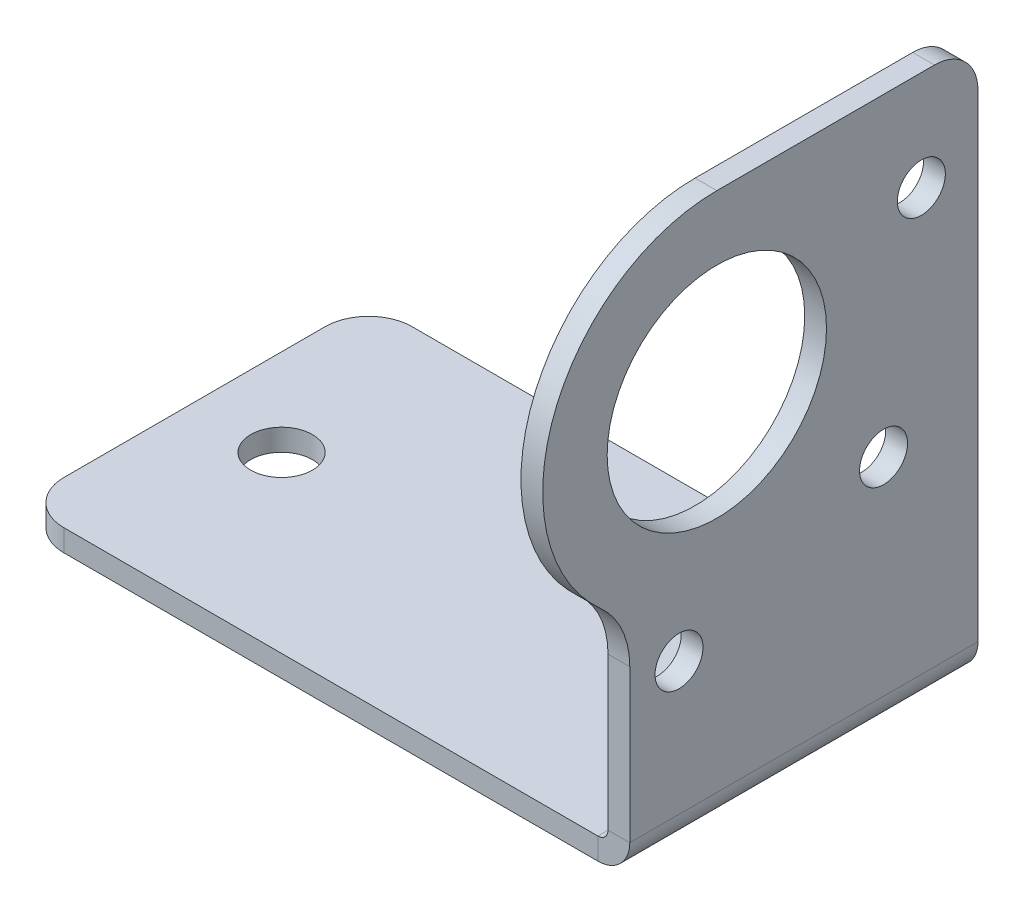
ISO-10303-21;
HEADER;
FILE_DESCRIPTION(('STEP AP214'),'2;1');
FILE_NAME('part.step','',(''),(''),'','','');
FILE_SCHEMA(('AUTOMOTIVE_DESIGN { 1 0 10303 214 1 1 1 1 }'));
ENDSEC;
DATA;
#1=APPLICATION_CONTEXT('core data for automotive mechanical design processes');
#2=APPLICATION_PROTOCOL_DEFINITION('international standard','automotive_design',2000,#1);
#3=PRODUCT_CONTEXT('',#1,'mechanical');
#4=PRODUCT('Part','Part','',(#3));
#5=PRODUCT_RELATED_PRODUCT_CATEGORY('part','',(#4));
#6=PRODUCT_DEFINITION_FORMATION('','',#4);
#7=PRODUCT_DEFINITION_CONTEXT('part definition',#1,'design');
#8=PRODUCT_DEFINITION('design','',#6,#7);
#9=PRODUCT_DEFINITION_SHAPE('','',#8);
#10=(LENGTH_UNIT() NAMED_UNIT(*) SI_UNIT(.MILLI.,.METRE.));
#11=(NAMED_UNIT(*) PLANE_ANGLE_UNIT() SI_UNIT($,.RADIAN.));
#12=(NAMED_UNIT(*) SI_UNIT($,.STERADIAN.) SOLID_ANGLE_UNIT());
#13=UNCERTAINTY_MEASURE_WITH_UNIT(LENGTH_MEASURE(1.E-05),#10,'distance_accuracy_value','');
#14=(GEOMETRIC_REPRESENTATION_CONTEXT(3) GLOBAL_UNCERTAINTY_ASSIGNED_CONTEXT((#13)) GLOBAL_UNIT_ASSIGNED_CONTEXT((#10,
#11,#12)) REPRESENTATION_CONTEXT('',''));
#15=CARTESIAN_POINT('',(0.,0.,0.));
#16=DIRECTION('',(0.,0.,1.));
#17=DIRECTION('',(1.,0.,0.));
#18=AXIS2_PLACEMENT_3D('',#15,#16,#17);
#19=CARTESIAN_POINT('',(36.5125,11.8578001841658,19.05));
#20=DIRECTION('',(1.,0.,0.));
#21=DIRECTION('',(0.,0.,-1.));
#22=AXIS2_PLACEMENT_3D('',#19,#20,#21);
#23=PLANE('',#22);
#24=CARTESIAN_POINT('',(36.5124999999999,26.0568318412894,6.35));
#25=DIRECTION('',(-1.,0.,0.));
#26=DIRECTION('',(0.,0.,1.));
#27=AXIS2_PLACEMENT_3D('',#24,#25,#26);
#28=CIRCLE('',#27,8.);
#29=CARTESIAN_POINT('',(36.5124999999999,26.0568318412894,14.35));
#30=VERTEX_POINT('',#29);
#31=EDGE_CURVE('E236',#30,#30,#28,.T.);
#32=ORIENTED_EDGE('',*,*,#31,.F.);
#33=EDGE_LOOP('',(#32));
#34=FACE_BOUND('',#33,.T.);
#35=CARTESIAN_POINT('',(36.5125,10.4230087622206,9.10666482046241));
#36=DIRECTION('',(-1.,0.,0.));
#37=DIRECTION('',(0.,0.,1.));
#38=AXIS2_PLACEMENT_3D('',#35,#36,#37);
#39=CIRCLE('',#38,1.75);
#40=CARTESIAN_POINT('',(36.5125,10.4230087622206,10.8566648204624));
#41=VERTEX_POINT('',#40);
#42=EDGE_CURVE('E230',#41,#41,#39,.T.);
#43=ORIENTED_EDGE('',*,*,#42,.F.);
#44=EDGE_LOOP('',(#43));
#45=FACE_BOUND('',#44,.T.);
#46=CARTESIAN_POINT('',(36.5125,15.8525785375157,-5.81095553451387));
#47=DIRECTION('',(-1.,0.,0.));
#48=DIRECTION('',(0.,0.,1.));
#49=AXIS2_PLACEMENT_3D('',#46,#47,#48);
#50=CIRCLE('',#49,1.75000000000001);
#51=CARTESIAN_POINT('',(36.5125,15.8525785375157,-4.06095553451386));
#52=VERTEX_POINT('',#51);
#53=EDGE_CURVE('E223',#52,#52,#50,.T.);
#54=ORIENTED_EDGE('',*,*,#53,.F.);
#55=EDGE_LOOP('',(#54));
#56=FACE_BOUND('',#55,.T.);
#57=CARTESIAN_POINT('',(36.5124999999999,31.4864016165846,-8.56762035497623));
#58=DIRECTION('',(-1.,0.,0.));
#59=DIRECTION('',(0.,0.,1.));
#60=AXIS2_PLACEMENT_3D('',#57,#58,#59);
#61=CIRCLE('',#60,1.75);
#62=CARTESIAN_POINT('',(36.5124999999999,31.4864016165846,-6.81762035497623));
#63=VERTEX_POINT('',#62);
#64=EDGE_CURVE('E224',#63,#63,#61,.T.);
#65=ORIENTED_EDGE('',*,*,#64,.F.);
#66=EDGE_LOOP('',(#65));
#67=FACE_BOUND('',#66,.T.);
#68=DIRECTION('',(0.,-1.,0.));
#69=VECTOR('',#68,1.);
#70=CARTESIAN_POINT('',(36.5125000000002,-40.6181681587106,-12.7));
#71=LINE('',#70,#69);
#72=CARTESIAN_POINT('',(36.5124999999999,35.5818318412894,-12.7));
#73=VERTEX_POINT('',#72);
#74=CARTESIAN_POINT('',(36.5125,0.736600000000004,-12.7));
#75=VERTEX_POINT('',#74);
#76=EDGE_CURVE('E63',#73,#75,#71,.T.);
#77=ORIENTED_EDGE('',*,*,#76,.T.);
#78=DIRECTION('',(0.,0.,1.));
#79=VECTOR('',#78,1.);
#80=CARTESIAN_POINT('',(36.5125,0.736600000000004,19.05));
#81=LINE('',#80,#79);
#82=CARTESIAN_POINT('',(36.5125,0.736600000000004,12.7));
#83=VERTEX_POINT('',#82);
#84=EDGE_CURVE('E55',#75,#83,#81,.T.);
#85=ORIENTED_EDGE('',*,*,#84,.T.);
#86=DIRECTION('',(0.,1.,0.));
#87=VECTOR('',#86,1.);
#88=CARTESIAN_POINT('',(36.5125000000002,-40.6181681587106,12.7));
#89=LINE('',#88,#87);
#90=CARTESIAN_POINT('',(36.5125,11.8578001841658,12.7));
#91=VERTEX_POINT('',#90);
#92=EDGE_CURVE('E71',#83,#91,#89,.T.);
#93=ORIENTED_EDGE('',*,*,#92,.T.);
#94=CARTESIAN_POINT('',(36.5125,11.8578001841658,19.05));
#95=DIRECTION('',(1.,0.,0.));
#96=DIRECTION('',(0.,0.,-1.));
#97=AXIS2_PLACEMENT_3D('',#94,#95,#96);
#98=CIRCLE('',#97,6.35);
#99=CARTESIAN_POINT('',(36.5125,16.5908107365403,14.8166666666667));
#100=VERTEX_POINT('',#99);
#101=EDGE_CURVE('E242',#91,#100,#98,.T.);
#102=ORIENTED_EDGE('',*,*,#101,.T.);
#103=CARTESIAN_POINT('',(36.5124999999999,26.0568318412894,6.35));
#104=DIRECTION('',(-1.,0.,0.));
#105=DIRECTION('',(0.,0.,1.));
#106=AXIS2_PLACEMENT_3D('',#103,#104,#105);
#107=CIRCLE('',#106,12.7);
#108=CARTESIAN_POINT('',(36.5124999999999,38.7568318412894,6.35));
#109=VERTEX_POINT('',#108);
#110=EDGE_CURVE('E260',#100,#109,#107,.T.);
#111=ORIENTED_EDGE('',*,*,#110,.T.);
#112=DIRECTION('',(0.,0.,-1.));
#113=VECTOR('',#112,1.);
#114=CARTESIAN_POINT('',(36.5124999999999,38.7568318412894,6.35));
#115=LINE('',#114,#113);
#116=CARTESIAN_POINT('',(36.5124999999999,38.7568318412894,-9.52499999999998));
#117=VERTEX_POINT('',#116);
#118=EDGE_CURVE('E263',#109,#117,#115,.T.);
#119=ORIENTED_EDGE('',*,*,#118,.T.);
#120=CARTESIAN_POINT('',(36.5124999999999,35.5818318412894,-9.525));
#121=DIRECTION('',(-1.,0.,0.));
#122=DIRECTION('',(0.,0.,-1.));
#123=AXIS2_PLACEMENT_3D('',#120,#121,#122);
#124=CIRCLE('',#123,3.175);
#125=EDGE_CURVE('E266',#117,#73,#124,.T.);
#126=ORIENTED_EDGE('',*,*,#125,.T.);
#127=EDGE_LOOP('',(#77,#85,#93,#102,#111,#119,#126));
#128=FACE_BOUND('',#127,.T.);
#129=ADVANCED_FACE('F46',(#34,#45,#56,#67,#128),#23,.F.);
#130=CARTESIAN_POINT('',(38.1000000000002,-40.6181681587105,12.7));
#131=DIRECTION('',(0.,0.,1.));
#132=DIRECTION('',(0.,1.,0.));
#133=AXIS2_PLACEMENT_3D('',#130,#131,#132);
#134=PLANE('',#133);
#135=DIRECTION('',(-1.,0.,0.));
#136=VECTOR('',#135,1.);
#137=CARTESIAN_POINT('',(38.1,0.736600000000011,12.7));
#138=LINE('',#137,#136);
#139=CARTESIAN_POINT('',(38.1,0.736600000000009,12.7));
#140=VERTEX_POINT('',#139);
#141=EDGE_CURVE('E281',#140,#83,#138,.T.);
#142=ORIENTED_EDGE('',*,*,#141,.F.);
#143=DIRECTION('',(0.,1.,0.));
#144=VECTOR('',#143,1.);
#145=CARTESIAN_POINT('',(38.1,0.656831841289431,12.7));
#146=LINE('',#145,#144);
#147=CARTESIAN_POINT('',(38.1,11.8578001841658,12.7));
#148=VERTEX_POINT('',#147);
#149=EDGE_CURVE('E50',#140,#148,#146,.T.);
#150=ORIENTED_EDGE('',*,*,#149,.T.);
#151=DIRECTION('',(-1.,0.,0.));
#152=VECTOR('',#151,1.);
#153=CARTESIAN_POINT('',(38.1,11.8578001841658,12.7));
#154=LINE('',#153,#152);
#155=EDGE_CURVE('E278',#148,#91,#154,.T.);
#156=ORIENTED_EDGE('',*,*,#155,.T.);
#157=ORIENTED_EDGE('',*,*,#92,.F.);
#158=EDGE_LOOP('',(#142,#150,#156,#157));
#159=FACE_BOUND('',#158,.T.);
#160=ADVANCED_FACE('F289',(#159),#134,.T.);
#161=CARTESIAN_POINT('',(38.1000000000002,-40.6181681587105,-12.7));
#162=DIRECTION('',(0.,0.,-1.));
#163=DIRECTION('',(0.,-1.,0.));
#164=AXIS2_PLACEMENT_3D('',#161,#162,#163);
#165=PLANE('',#164);
#166=DIRECTION('',(1.,0.,0.));
#167=VECTOR('',#166,1.);
#168=CARTESIAN_POINT('',(38.1,0.736600000000011,-12.7));
#169=LINE('',#168,#167);
#170=CARTESIAN_POINT('',(38.1,0.736600000000011,-12.7));
#171=VERTEX_POINT('',#170);
#172=EDGE_CURVE('E12',#75,#171,#169,.T.);
#173=ORIENTED_EDGE('',*,*,#172,.F.);
#174=ORIENTED_EDGE('',*,*,#76,.F.);
#175=DIRECTION('',(-1.,0.,0.));
#176=VECTOR('',#175,1.);
#177=CARTESIAN_POINT('',(38.0999999999999,35.5818318412894,-12.7));
#178=LINE('',#177,#176);
#179=CARTESIAN_POINT('',(38.0999999999999,35.5818318412894,-12.7));
#180=VERTEX_POINT('',#179);
#181=EDGE_CURVE('E268',#180,#73,#178,.T.);
#182=ORIENTED_EDGE('',*,*,#181,.F.);
#183=DIRECTION('',(0.,-1.,0.));
#184=VECTOR('',#183,1.);
#185=CARTESIAN_POINT('',(38.1,0.656831841289431,-12.7));
#186=LINE('',#185,#184);
#187=EDGE_CURVE('E257',#180,#171,#186,.T.);
#188=ORIENTED_EDGE('',*,*,#187,.T.);
#189=EDGE_LOOP('',(#173,#174,#182,#188));
#190=FACE_BOUND('',#189,.T.);
#191=ADVANCED_FACE('F48',(#190),#165,.T.);
#192=CARTESIAN_POINT('',(38.0999999999999,35.5818318412894,-9.525));
#193=DIRECTION('',(-1.,0.,0.));
#194=DIRECTION('',(0.,0.,1.));
#195=AXIS2_PLACEMENT_3D('',#192,#193,#194);
#196=CYLINDRICAL_SURFACE('',#195,3.175);
#197=ORIENTED_EDGE('',*,*,#125,.F.);
#198=DIRECTION('',(-1.,0.,0.));
#199=VECTOR('',#198,1.);
#200=CARTESIAN_POINT('',(38.0999999999999,38.7568318412894,-9.52499999999998));
#201=LINE('',#200,#199);
#202=CARTESIAN_POINT('',(38.0999999999999,38.7568318412894,-9.52499999999998));
#203=VERTEX_POINT('',#202);
#204=EDGE_CURVE('E272',#203,#117,#201,.T.);
#205=ORIENTED_EDGE('',*,*,#204,.F.);
#206=CARTESIAN_POINT('',(38.0999999999999,35.5818318412894,-9.525));
#207=DIRECTION('',(-1.,0.,0.));
#208=DIRECTION('',(0.,0.,-1.));
#209=AXIS2_PLACEMENT_3D('',#206,#207,#208);
#210=CIRCLE('',#209,3.175);
#211=EDGE_CURVE('E254',#203,#180,#210,.T.);
#212=ORIENTED_EDGE('',*,*,#211,.T.);
#213=ORIENTED_EDGE('',*,*,#181,.T.);
#214=EDGE_LOOP('',(#197,#205,#212,#213));
#215=FACE_BOUND('',#214,.T.);
#216=ADVANCED_FACE('F323',(#215),#196,.T.);
#217=CARTESIAN_POINT('',(38.0999999999999,38.7568318412894,6.35));
#218=DIRECTION('',(0.,1.,0.));
#219=DIRECTION('',(0.,0.,-1.));
#220=AXIS2_PLACEMENT_3D('',#217,#218,#219);
#221=PLANE('',#220);
#222=ORIENTED_EDGE('',*,*,#118,.F.);
#223=DIRECTION('',(-1.,0.,0.));
#224=VECTOR('',#223,1.);
#225=CARTESIAN_POINT('',(38.0999999999999,38.7568318412894,6.35));
#226=LINE('',#225,#224);
#227=CARTESIAN_POINT('',(38.0999999999999,38.7568318412894,6.35));
#228=VERTEX_POINT('',#227);
#229=EDGE_CURVE('E274',#228,#109,#226,.T.);
#230=ORIENTED_EDGE('',*,*,#229,.F.);
#231=DIRECTION('',(0.,0.,-1.));
#232=VECTOR('',#231,1.);
#233=CARTESIAN_POINT('',(38.0999999999999,38.7568318412894,6.35));
#234=LINE('',#233,#232);
#235=EDGE_CURVE('E251',#228,#203,#234,.T.);
#236=ORIENTED_EDGE('',*,*,#235,.T.);
#237=ORIENTED_EDGE('',*,*,#204,.T.);
#238=EDGE_LOOP('',(#222,#230,#236,#237));
#239=FACE_BOUND('',#238,.T.);
#240=ADVANCED_FACE('F320',(#239),#221,.T.);
#241=CARTESIAN_POINT('',(38.0999999999999,26.0568318412894,6.35));
#242=DIRECTION('',(-1.,0.,0.));
#243=DIRECTION('',(0.,0.,1.));
#244=AXIS2_PLACEMENT_3D('',#241,#242,#243);
#245=CYLINDRICAL_SURFACE('',#244,12.7);
#246=ORIENTED_EDGE('',*,*,#110,.F.);
#247=DIRECTION('',(-1.,0.,0.));
#248=VECTOR('',#247,1.);
#249=CARTESIAN_POINT('',(38.1,16.5908107365403,14.8166666666667));
#250=LINE('',#249,#248);
#251=CARTESIAN_POINT('',(38.1,16.5908107365403,14.8166666666667));
#252=VERTEX_POINT('',#251);
#253=EDGE_CURVE('E276',#252,#100,#250,.T.);
#254=ORIENTED_EDGE('',*,*,#253,.F.);
#255=CARTESIAN_POINT('',(38.0999999999999,26.0568318412894,6.35));
#256=DIRECTION('',(-1.,0.,0.));
#257=DIRECTION('',(0.,0.,1.));
#258=AXIS2_PLACEMENT_3D('',#255,#256,#257);
#259=CIRCLE('',#258,12.7);
#260=EDGE_CURVE('E248',#252,#228,#259,.T.);
#261=ORIENTED_EDGE('',*,*,#260,.T.);
#262=ORIENTED_EDGE('',*,*,#229,.T.);
#263=EDGE_LOOP('',(#246,#254,#261,#262));
#264=FACE_BOUND('',#263,.T.);
#265=ADVANCED_FACE('F302',(#264),#245,.T.);
#266=CARTESIAN_POINT('',(38.1,11.8578001841658,19.05));
#267=DIRECTION('',(-1.,0.,0.));
#268=DIRECTION('',(0.,0.,1.));
#269=AXIS2_PLACEMENT_3D('',#266,#267,#268);
#270=CYLINDRICAL_SURFACE('',#269,6.35);
#271=ORIENTED_EDGE('',*,*,#101,.F.);
#272=ORIENTED_EDGE('',*,*,#155,.F.);
#273=CARTESIAN_POINT('',(38.1,11.8578001841658,19.05));
#274=DIRECTION('',(1.,0.,0.));
#275=DIRECTION('',(0.,0.,-1.));
#276=AXIS2_PLACEMENT_3D('',#273,#274,#275);
#277=CIRCLE('',#276,6.35);
#278=EDGE_CURVE('E245',#148,#252,#277,.T.);
#279=ORIENTED_EDGE('',*,*,#278,.T.);
#280=ORIENTED_EDGE('',*,*,#253,.T.);
#281=EDGE_LOOP('',(#271,#272,#279,#280));
#282=FACE_BOUND('',#281,.T.);
#283=ADVANCED_FACE('F294',(#282),#270,.F.);
#284=CARTESIAN_POINT('',(38.1,11.8578001841658,19.05));
#285=DIRECTION('',(1.,0.,0.));
#286=DIRECTION('',(0.,0.,-1.));
#287=AXIS2_PLACEMENT_3D('',#284,#285,#286);
#288=PLANE('',#287);
#289=DIRECTION('',(0.,0.,1.));
#290=VECTOR('',#289,1.);
#291=CARTESIAN_POINT('',(38.1,0.736600000000011,19.05));
#292=LINE('',#291,#290);
#293=EDGE_CURVE('E271',#171,#140,#292,.T.);
#294=ORIENTED_EDGE('',*,*,#293,.F.);
#295=ORIENTED_EDGE('',*,*,#187,.F.);
#296=ORIENTED_EDGE('',*,*,#211,.F.);
#297=ORIENTED_EDGE('',*,*,#235,.F.);
#298=ORIENTED_EDGE('',*,*,#260,.F.);
#299=ORIENTED_EDGE('',*,*,#278,.F.);
#300=ORIENTED_EDGE('',*,*,#149,.F.);
#301=EDGE_LOOP('',(#294,#295,#296,#297,#298,#299,#300));
#302=FACE_BOUND('',#301,.T.);
#303=CARTESIAN_POINT('',(38.0999999999999,31.4864016165846,-8.56762035497623));
#304=DIRECTION('',(-1.,0.,0.));
#305=DIRECTION('',(0.,0.,1.));
#306=AXIS2_PLACEMENT_3D('',#303,#304,#305);
#307=CIRCLE('',#306,1.75);
#308=CARTESIAN_POINT('',(38.0999999999999,31.4864016165846,-6.81762035497623));
#309=VERTEX_POINT('',#308);
#310=EDGE_CURVE('E220',#309,#309,#307,.T.);
#311=ORIENTED_EDGE('',*,*,#310,.T.);
#312=EDGE_LOOP('',(#311));
#313=FACE_BOUND('',#312,.T.);
#314=CARTESIAN_POINT('',(38.1,15.8525785375157,-5.81095553451387));
#315=DIRECTION('',(-1.,0.,0.));
#316=DIRECTION('',(0.,0.,1.));
#317=AXIS2_PLACEMENT_3D('',#314,#315,#316);
#318=CIRCLE('',#317,1.75000000000001);
#319=CARTESIAN_POINT('',(38.1,15.8525785375157,-4.06095553451386));
#320=VERTEX_POINT('',#319);
#321=EDGE_CURVE('E227',#320,#320,#318,.T.);
#322=ORIENTED_EDGE('',*,*,#321,.T.);
#323=EDGE_LOOP('',(#322));
#324=FACE_BOUND('',#323,.T.);
#325=CARTESIAN_POINT('',(38.1,10.4230087622206,9.10666482046241));
#326=DIRECTION('',(-1.,0.,0.));
#327=DIRECTION('',(0.,0.,1.));
#328=AXIS2_PLACEMENT_3D('',#325,#326,#327);
#329=CIRCLE('',#328,1.75);
#330=CARTESIAN_POINT('',(38.1,10.4230087622206,10.8566648204624));
#331=VERTEX_POINT('',#330);
#332=EDGE_CURVE('E233',#331,#331,#329,.T.);
#333=ORIENTED_EDGE('',*,*,#332,.T.);
#334=EDGE_LOOP('',(#333));
#335=FACE_BOUND('',#334,.T.);
#336=CARTESIAN_POINT('',(38.0999999999999,26.0568318412894,6.35));
#337=DIRECTION('',(-1.,0.,0.));
#338=DIRECTION('',(0.,0.,1.));
#339=AXIS2_PLACEMENT_3D('',#336,#337,#338);
#340=CIRCLE('',#339,8.);
#341=CARTESIAN_POINT('',(38.0999999999999,26.0568318412894,14.35));
#342=VERTEX_POINT('',#341);
#343=EDGE_CURVE('E239',#342,#342,#340,.T.);
#344=ORIENTED_EDGE('',*,*,#343,.T.);
#345=EDGE_LOOP('',(#344));
#346=FACE_BOUND('',#345,.T.);
#347=ADVANCED_FACE('F296',(#302,#313,#324,#335,#346),#288,.T.);
#348=CARTESIAN_POINT('',(38.0999999999999,26.0568318412894,6.35));
#349=DIRECTION('',(-1.,0.,0.));
#350=DIRECTION('',(0.,0.,1.));
#351=AXIS2_PLACEMENT_3D('',#348,#349,#350);
#352=CYLINDRICAL_SURFACE('',#351,8.);
#353=ORIENTED_EDGE('',*,*,#343,.F.);
#354=EDGE_LOOP('',(#353));
#355=FACE_BOUND('',#354,.T.);
#356=ORIENTED_EDGE('',*,*,#31,.T.);
#357=EDGE_LOOP('',(#356));
#358=FACE_BOUND('',#357,.T.);
#359=ADVANCED_FACE('F315',(#355,#358),#352,.F.);
#360=CARTESIAN_POINT('',(38.1,10.4230087622206,9.10666482046241));
#361=DIRECTION('',(-1.,0.,0.));
#362=DIRECTION('',(0.,0.,1.));
#363=AXIS2_PLACEMENT_3D('',#360,#361,#362);
#364=CYLINDRICAL_SURFACE('',#363,1.75);
#365=ORIENTED_EDGE('',*,*,#332,.F.);
#366=EDGE_LOOP('',(#365));
#367=FACE_BOUND('',#366,.T.);
#368=ORIENTED_EDGE('',*,*,#42,.T.);
#369=EDGE_LOOP('',(#368));
#370=FACE_BOUND('',#369,.T.);
#371=ADVANCED_FACE('F330',(#367,#370),#364,.F.);
#372=CARTESIAN_POINT('',(38.1,15.8525785375157,-5.81095553451387));
#373=DIRECTION('',(-1.,0.,0.));
#374=DIRECTION('',(0.,0.,1.));
#375=AXIS2_PLACEMENT_3D('',#372,#373,#374);
#376=CYLINDRICAL_SURFACE('',#375,1.75000000000001);
#377=ORIENTED_EDGE('',*,*,#321,.F.);
#378=EDGE_LOOP('',(#377));
#379=FACE_BOUND('',#378,.T.);
#380=ORIENTED_EDGE('',*,*,#53,.T.);
#381=EDGE_LOOP('',(#380));
#382=FACE_BOUND('',#381,.T.);
#383=ADVANCED_FACE('F334',(#379,#382),#376,.F.);
#384=CARTESIAN_POINT('',(38.0999999999999,31.4864016165846,-8.56762035497623));
#385=DIRECTION('',(-1.,0.,0.));
#386=DIRECTION('',(0.,0.,1.));
#387=AXIS2_PLACEMENT_3D('',#384,#385,#386);
#388=CYLINDRICAL_SURFACE('',#387,1.75);
#389=ORIENTED_EDGE('',*,*,#310,.F.);
#390=EDGE_LOOP('',(#389));
#391=FACE_BOUND('',#390,.T.);
#392=ORIENTED_EDGE('',*,*,#64,.T.);
#393=EDGE_LOOP('',(#392));
#394=FACE_BOUND('',#393,.T.);
#395=ADVANCED_FACE('F338',(#391,#394),#388,.F.);
#396=CARTESIAN_POINT('',(-3.175,-1.5875,-9.525));
#397=DIRECTION('',(0.,1.,0.));
#398=DIRECTION('',(0.,0.,1.));
#399=AXIS2_PLACEMENT_3D('',#396,#397,#398);
#400=CYLINDRICAL_SURFACE('',#399,3.175);
#401=CARTESIAN_POINT('',(-3.175,0.,-9.525));
#402=DIRECTION('',(0.,1.,0.));
#403=DIRECTION('',(0.,0.,1.));
#404=AXIS2_PLACEMENT_3D('',#401,#402,#403);
#405=CIRCLE('',#404,3.175);
#406=CARTESIAN_POINT('',(-3.17499999999998,0.,-12.7));
#407=VERTEX_POINT('',#406);
#408=CARTESIAN_POINT('',(-6.35,0.,-9.52499999999998));
#409=VERTEX_POINT('',#408);
#410=EDGE_CURVE('E192',#407,#409,#405,.T.);
#411=ORIENTED_EDGE('',*,*,#410,.F.);
#412=DIRECTION('',(0.,1.,0.));
#413=VECTOR('',#412,1.);
#414=CARTESIAN_POINT('',(-3.17499999999998,-1.5875,-12.7));
#415=LINE('',#414,#413);
#416=CARTESIAN_POINT('',(-3.17499999999998,-1.5875,-12.7));
#417=VERTEX_POINT('',#416);
#418=EDGE_CURVE('E174',#417,#407,#415,.T.);
#419=ORIENTED_EDGE('',*,*,#418,.F.);
#420=CARTESIAN_POINT('',(-3.175,-1.5875,-9.525));
#421=DIRECTION('',(0.,1.,0.));
#422=DIRECTION('',(0.,0.,1.));
#423=AXIS2_PLACEMENT_3D('',#420,#421,#422);
#424=CIRCLE('',#423,3.175);
#425=CARTESIAN_POINT('',(-6.35,-1.5875,-9.52499999999998));
#426=VERTEX_POINT('',#425);
#427=EDGE_CURVE('E170',#417,#426,#424,.T.);
#428=ORIENTED_EDGE('',*,*,#427,.T.);
#429=DIRECTION('',(0.,1.,0.));
#430=VECTOR('',#429,1.);
#431=CARTESIAN_POINT('',(-6.35,-1.5875,-9.52499999999998));
#432=LINE('',#431,#430);
#433=EDGE_CURVE('E215',#426,#409,#432,.T.);
#434=ORIENTED_EDGE('',*,*,#433,.T.);
#435=EDGE_LOOP('',(#411,#419,#428,#434));
#436=FACE_BOUND('',#435,.T.);
#437=ADVANCED_FACE('F342',(#436),#400,.T.);
#438=CARTESIAN_POINT('',(-6.35,-1.5875,-9.52499999999998));
#439=DIRECTION('',(-1.,0.,0.));
#440=DIRECTION('',(0.,0.,1.));
#441=AXIS2_PLACEMENT_3D('',#438,#439,#440);
#442=PLANE('',#441);
#443=DIRECTION('',(0.,0.,1.));
#444=VECTOR('',#443,1.);
#445=CARTESIAN_POINT('',(-6.35,0.,-9.52499999999998));
#446=LINE('',#445,#444);
#447=CARTESIAN_POINT('',(-6.35,0.,9.52499999999998));
#448=VERTEX_POINT('',#447);
#449=EDGE_CURVE('E189',#409,#448,#446,.T.);
#450=ORIENTED_EDGE('',*,*,#449,.F.);
#451=ORIENTED_EDGE('',*,*,#433,.F.);
#452=DIRECTION('',(0.,0.,1.));
#453=VECTOR('',#452,1.);
#454=CARTESIAN_POINT('',(-6.35,-1.5875,-9.52499999999998));
#455=LINE('',#454,#453);
#456=CARTESIAN_POINT('',(-6.35,-1.5875,9.52499999999998));
#457=VERTEX_POINT('',#456);
#458=EDGE_CURVE('E212',#426,#457,#455,.T.);
#459=ORIENTED_EDGE('',*,*,#458,.T.);
#460=DIRECTION('',(0.,1.,0.));
#461=VECTOR('',#460,1.);
#462=CARTESIAN_POINT('',(-6.35,-1.5875,9.52499999999998));
#463=LINE('',#462,#461);
#464=EDGE_CURVE('E210',#457,#448,#463,.T.);
#465=ORIENTED_EDGE('',*,*,#464,.T.);
#466=EDGE_LOOP('',(#450,#451,#459,#465));
#467=FACE_BOUND('',#466,.T.);
#468=ADVANCED_FACE('F364',(#467),#442,.T.);
#469=CARTESIAN_POINT('',(-3.175,-1.5875,9.525));
#470=DIRECTION('',(0.,1.,0.));
#471=DIRECTION('',(0.,0.,1.));
#472=AXIS2_PLACEMENT_3D('',#469,#470,#471);
#473=CYLINDRICAL_SURFACE('',#472,3.175);
#474=CARTESIAN_POINT('',(-3.175,0.,9.525));
#475=DIRECTION('',(0.,1.,0.));
#476=DIRECTION('',(0.,0.,1.));
#477=AXIS2_PLACEMENT_3D('',#474,#475,#476);
#478=CIRCLE('',#477,3.175);
#479=CARTESIAN_POINT('',(-3.17499999999998,0.,12.7));
#480=VERTEX_POINT('',#479);
#481=EDGE_CURVE('E183',#448,#480,#478,.T.);
#482=ORIENTED_EDGE('',*,*,#481,.F.);
#483=ORIENTED_EDGE('',*,*,#464,.F.);
#484=CARTESIAN_POINT('',(-3.175,-1.5875,9.525));
#485=DIRECTION('',(0.,1.,0.));
#486=DIRECTION('',(0.,0.,1.));
#487=AXIS2_PLACEMENT_3D('',#484,#485,#486);
#488=CIRCLE('',#487,3.175);
#489=CARTESIAN_POINT('',(-3.17499999999998,-1.5875,12.7));
#490=VERTEX_POINT('',#489);
#491=EDGE_CURVE('E207',#457,#490,#488,.T.);
#492=ORIENTED_EDGE('',*,*,#491,.T.);
#493=DIRECTION('',(0.,1.,0.));
#494=VECTOR('',#493,1.);
#495=CARTESIAN_POINT('',(-3.17499999999998,-1.5875,12.7));
#496=LINE('',#495,#494);
#497=EDGE_CURVE('E205',#490,#480,#496,.T.);
#498=ORIENTED_EDGE('',*,*,#497,.T.);
#499=EDGE_LOOP('',(#482,#483,#492,#498));
#500=FACE_BOUND('',#499,.T.);
#501=ADVANCED_FACE('F360',(#500),#473,.T.);
#502=CARTESIAN_POINT('',(0.,-1.5875,0.));
#503=DIRECTION('',(0.,1.,0.));
#504=DIRECTION('',(0.,0.,1.));
#505=AXIS2_PLACEMENT_3D('',#502,#503,#504);
#506=CYLINDRICAL_SURFACE('',#505,2.25);
#507=CARTESIAN_POINT('',(0.,-1.5875,0.));
#508=DIRECTION('',(0.,1.,0.));
#509=DIRECTION('',(0.,0.,1.));
#510=AXIS2_PLACEMENT_3D('',#507,#508,#509);
#511=CIRCLE('',#510,2.25);
#512=CARTESIAN_POINT('',(0.,-1.5875,2.25));
#513=VERTEX_POINT('',#512);
#514=EDGE_CURVE('E163',#513,#513,#511,.T.);
#515=ORIENTED_EDGE('',*,*,#514,.F.);
#516=EDGE_LOOP('',(#515));
#517=FACE_BOUND('',#516,.T.);
#518=CARTESIAN_POINT('',(0.,0.,0.));
#519=DIRECTION('',(0.,1.,0.));
#520=DIRECTION('',(0.,0.,1.));
#521=AXIS2_PLACEMENT_3D('',#518,#519,#520);
#522=CIRCLE('',#521,2.25);
#523=CARTESIAN_POINT('',(0.,0.,2.25));
#524=VERTEX_POINT('',#523);
#525=EDGE_CURVE('E202',#524,#524,#522,.T.);
#526=ORIENTED_EDGE('',*,*,#525,.T.);
#527=EDGE_LOOP('',(#526));
#528=FACE_BOUND('',#527,.T.);
#529=ADVANCED_FACE('F356',(#517,#528),#506,.F.);
#530=CARTESIAN_POINT('',(49.3009683428763,-1.5875,19.05));
#531=DIRECTION('',(0.,-1.,0.));
#532=DIRECTION('',(0.,0.,-1.));
#533=AXIS2_PLACEMENT_3D('',#530,#531,#532);
#534=PLANE('',#533);
#535=ORIENTED_EDGE('',*,*,#514,.T.);
#536=EDGE_LOOP('',(#535));
#537=FACE_BOUND('',#536,.T.);
#538=DIRECTION('',(-1.,0.,0.));
#539=VECTOR('',#538,1.);
#540=CARTESIAN_POINT('',(38.1,-1.5875,-12.7));
#541=LINE('',#540,#539);
#542=CARTESIAN_POINT('',(35.7759,-1.5875,-12.7));
#543=VERTEX_POINT('',#542);
#544=EDGE_CURVE('E166',#543,#417,#541,.T.);
#545=ORIENTED_EDGE('',*,*,#544,.F.);
#546=DIRECTION('',(0.,0.,1.));
#547=VECTOR('',#546,1.);
#548=CARTESIAN_POINT('',(35.7759,-1.5875,19.05));
#549=LINE('',#548,#547);
#550=CARTESIAN_POINT('',(35.7759,-1.5875,12.7));
#551=VERTEX_POINT('',#550);
#552=EDGE_CURVE('E156',#543,#551,#549,.T.);
#553=ORIENTED_EDGE('',*,*,#552,.T.);
#554=DIRECTION('',(1.,0.,0.));
#555=VECTOR('',#554,1.);
#556=CARTESIAN_POINT('',(38.1,-1.5875,12.7));
#557=LINE('',#556,#555);
#558=EDGE_CURVE('E162',#490,#551,#557,.T.);
#559=ORIENTED_EDGE('',*,*,#558,.F.);
#560=ORIENTED_EDGE('',*,*,#491,.F.);
#561=ORIENTED_EDGE('',*,*,#458,.F.);
#562=ORIENTED_EDGE('',*,*,#427,.F.);
#563=EDGE_LOOP('',(#545,#553,#559,#560,#561,#562));
#564=FACE_BOUND('',#563,.T.);
#565=ADVANCED_FACE('F167',(#537,#564),#534,.T.);
#566=CARTESIAN_POINT('',(-3.17499999999998,-1.5875,12.7));
#567=DIRECTION('',(0.,0.,1.));
#568=DIRECTION('',(1.,0.,0.));
#569=AXIS2_PLACEMENT_3D('',#566,#567,#568);
#570=PLANE('',#569);
#571=ORIENTED_EDGE('',*,*,#558,.T.);
#572=DIRECTION('',(0.,1.,0.));
#573=VECTOR('',#572,1.);
#574=CARTESIAN_POINT('',(35.7759,-1.5875,12.7));
#575=LINE('',#574,#573);
#576=CARTESIAN_POINT('',(35.7759,0.,12.7));
#577=VERTEX_POINT('',#576);
#578=EDGE_CURVE('E196',#551,#577,#575,.T.);
#579=ORIENTED_EDGE('',*,*,#578,.T.);
#580=DIRECTION('',(1.,0.,0.));
#581=VECTOR('',#580,1.);
#582=CARTESIAN_POINT('',(-3.17499999999998,0.,12.7));
#583=LINE('',#582,#581);
#584=EDGE_CURVE('E180',#480,#577,#583,.T.);
#585=ORIENTED_EDGE('',*,*,#584,.F.);
#586=ORIENTED_EDGE('',*,*,#497,.F.);
#587=EDGE_LOOP('',(#571,#579,#585,#586));
#588=FACE_BOUND('',#587,.T.);
#589=ADVANCED_FACE('F349',(#588),#570,.T.);
#590=CARTESIAN_POINT('',(49.3009683428763,0.,19.05));
#591=DIRECTION('',(0.,-1.,0.));
#592=DIRECTION('',(0.,0.,-1.));
#593=AXIS2_PLACEMENT_3D('',#590,#591,#592);
#594=PLANE('',#593);
#595=DIRECTION('',(0.,0.,1.));
#596=VECTOR('',#595,1.);
#597=CARTESIAN_POINT('',(35.7759,0.,19.05));
#598=LINE('',#597,#596);
#599=CARTESIAN_POINT('',(35.7759,0.,-12.7));
#600=VERTEX_POINT('',#599);
#601=EDGE_CURVE('E218',#600,#577,#598,.T.);
#602=ORIENTED_EDGE('',*,*,#601,.F.);
#603=DIRECTION('',(-1.,0.,0.));
#604=VECTOR('',#603,1.);
#605=CARTESIAN_POINT('',(-3.17499999999998,0.,-12.7));
#606=LINE('',#605,#604);
#607=EDGE_CURVE('E178',#600,#407,#606,.T.);
#608=ORIENTED_EDGE('',*,*,#607,.T.);
#609=ORIENTED_EDGE('',*,*,#410,.T.);
#610=ORIENTED_EDGE('',*,*,#449,.T.);
#611=ORIENTED_EDGE('',*,*,#481,.T.);
#612=ORIENTED_EDGE('',*,*,#584,.T.);
#613=EDGE_LOOP('',(#602,#608,#609,#610,#611,#612));
#614=FACE_BOUND('',#613,.T.);
#615=ORIENTED_EDGE('',*,*,#525,.F.);
#616=EDGE_LOOP('',(#615));
#617=FACE_BOUND('',#616,.T.);
#618=ADVANCED_FACE('F346',(#614,#617),#594,.F.);
#619=CARTESIAN_POINT('',(-3.17499999999998,-1.5875,-12.7));
#620=DIRECTION('',(0.,0.,-1.));
#621=DIRECTION('',(-1.,0.,0.));
#622=AXIS2_PLACEMENT_3D('',#619,#620,#621);
#623=PLANE('',#622);
#624=ORIENTED_EDGE('',*,*,#607,.F.);
#625=DIRECTION('',(0.,-1.,0.));
#626=VECTOR('',#625,1.);
#627=CARTESIAN_POINT('',(35.7759,-1.5875,-12.7));
#628=LINE('',#627,#626);
#629=EDGE_CURVE('E147',#600,#543,#628,.T.);
#630=ORIENTED_EDGE('',*,*,#629,.T.);
#631=ORIENTED_EDGE('',*,*,#544,.T.);
#632=ORIENTED_EDGE('',*,*,#418,.T.);
#633=EDGE_LOOP('',(#624,#630,#631,#632));
#634=FACE_BOUND('',#633,.T.);
#635=ADVANCED_FACE('F177',(#634),#623,.T.);
#636=CARTESIAN_POINT('',(35.7759,0.7366,-12.7));
#637=DIRECTION('',(0.,0.,-1.));
#638=DIRECTION('',(-1.,0.,0.));
#639=AXIS2_PLACEMENT_3D('',#636,#637,#638);
#640=PLANE('',#639);
#641=ORIENTED_EDGE('',*,*,#629,.F.);
#642=CARTESIAN_POINT('',(35.7759,0.7366,-12.7));
#643=DIRECTION('',(0.,0.,1.));
#644=DIRECTION('',(1.,0.,0.));
#645=AXIS2_PLACEMENT_3D('',#642,#643,#644);
#646=CIRCLE('',#645,0.7366);
#647=EDGE_CURVE('E586',#600,#75,#646,.T.);
#648=ORIENTED_EDGE('',*,*,#647,.T.);
#649=ORIENTED_EDGE('',*,*,#172,.T.);
#650=CARTESIAN_POINT('',(35.7759,0.7366,-12.7));
#651=DIRECTION('',(0.,0.,1.));
#652=DIRECTION('',(-1.,0.,0.));
#653=AXIS2_PLACEMENT_3D('',#650,#651,#652);
#654=CIRCLE('',#653,2.3241);
#655=EDGE_CURVE('E142',#543,#171,#654,.T.);
#656=ORIENTED_EDGE('',*,*,#655,.F.);
#657=EDGE_LOOP('',(#641,#648,#649,#656));
#658=FACE_BOUND('',#657,.T.);
#659=ADVANCED_FACE('F144',(#658),#640,.T.);
#660=CARTESIAN_POINT('',(35.7759,0.7366,12.7));
#661=DIRECTION('',(0.,0.,1.));
#662=DIRECTION('',(1.,0.,0.));
#663=AXIS2_PLACEMENT_3D('',#660,#661,#662);
#664=PLANE('',#663);
#665=ORIENTED_EDGE('',*,*,#141,.T.);
#666=CARTESIAN_POINT('',(35.7759,0.7366,12.7));
#667=DIRECTION('',(0.,0.,1.));
#668=DIRECTION('',(1.,0.,0.));
#669=AXIS2_PLACEMENT_3D('',#666,#667,#668);
#670=CIRCLE('',#669,0.7366);
#671=EDGE_CURVE('E152',#83,#577,#670,.F.);
#672=ORIENTED_EDGE('',*,*,#671,.T.);
#673=ORIENTED_EDGE('',*,*,#578,.F.);
#674=CARTESIAN_POINT('',(35.7759,0.7366,12.7));
#675=DIRECTION('',(0.,0.,-1.));
#676=DIRECTION('',(1.,0.,0.));
#677=AXIS2_PLACEMENT_3D('',#674,#675,#676);
#678=CIRCLE('',#677,2.3241);
#679=EDGE_CURVE('E151',#140,#551,#678,.T.);
#680=ORIENTED_EDGE('',*,*,#679,.F.);
#681=EDGE_LOOP('',(#665,#672,#673,#680));
#682=FACE_BOUND('',#681,.T.);
#683=ADVANCED_FACE('F374',(#682),#664,.T.);
#684=CARTESIAN_POINT('',(35.7759,0.7366,-25.5628390124114));
#685=DIRECTION('',(0.,0.,1.));
#686=DIRECTION('',(1.,0.,0.));
#687=AXIS2_PLACEMENT_3D('',#684,#685,#686);
#688=CYLINDRICAL_SURFACE('',#687,2.3241);
#689=ORIENTED_EDGE('',*,*,#679,.T.);
#690=ORIENTED_EDGE('',*,*,#552,.F.);
#691=ORIENTED_EDGE('',*,*,#655,.T.);
#692=ORIENTED_EDGE('',*,*,#293,.T.);
#693=EDGE_LOOP('',(#689,#690,#691,#692));
#694=FACE_BOUND('',#693,.T.);
#695=ADVANCED_FACE('F158',(#694),#688,.T.);
#696=CARTESIAN_POINT('',(35.7759,0.7366,-25.5628390124114));
#697=DIRECTION('',(0.,0.,1.));
#698=DIRECTION('',(1.,0.,0.));
#699=AXIS2_PLACEMENT_3D('',#696,#697,#698);
#700=CYLINDRICAL_SURFACE('',#699,0.7366);
#701=ORIENTED_EDGE('',*,*,#671,.F.);
#702=ORIENTED_EDGE('',*,*,#84,.F.);
#703=ORIENTED_EDGE('',*,*,#647,.F.);
#704=ORIENTED_EDGE('',*,*,#601,.T.);
#705=EDGE_LOOP('',(#701,#702,#703,#704));
#706=FACE_BOUND('',#705,.T.);
#707=ADVANCED_FACE('F378',(#706),#700,.F.);
#708=CLOSED_SHELL('',(#129,#160,#191,#216,#240,#265,#283,#347,#359,#371,#383,#395,#437,#468,
#501,#529,#565,#589,#618,#635,#659,#683,#695,#707));
#709=MANIFOLD_SOLID_BREP('B2',#708);
#710=ADVANCED_BREP_SHAPE_REPRESENTATION('',(#18,#709),#14);
#711=SHAPE_DEFINITION_REPRESENTATION(#9,#710);
ENDSEC;
END-ISO-10303-21;
